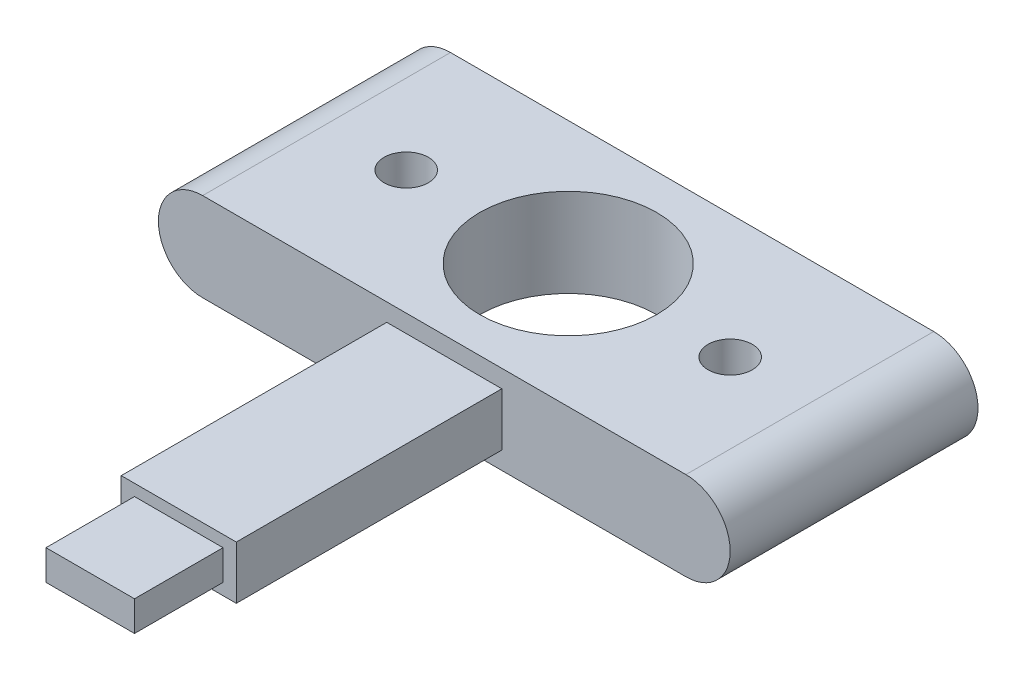
ISO-10303-21;
HEADER;
FILE_DESCRIPTION(('STEP AP214'),'2;1');
FILE_NAME('part.step','',(''),(''),'','','');
FILE_SCHEMA(('AUTOMOTIVE_DESIGN { 1 0 10303 214 1 1 1 1 }'));
ENDSEC;
DATA;
#1=APPLICATION_CONTEXT('core data for automotive mechanical design processes');
#2=APPLICATION_PROTOCOL_DEFINITION('international standard','automotive_design',2000,#1);
#3=PRODUCT_CONTEXT('',#1,'mechanical');
#4=PRODUCT('Part','Part','',(#3));
#5=PRODUCT_RELATED_PRODUCT_CATEGORY('part','',(#4));
#6=PRODUCT_DEFINITION_FORMATION('','',#4);
#7=PRODUCT_DEFINITION_CONTEXT('part definition',#1,'design');
#8=PRODUCT_DEFINITION('design','',#6,#7);
#9=PRODUCT_DEFINITION_SHAPE('','',#8);
#10=(LENGTH_UNIT() NAMED_UNIT(*) SI_UNIT(.MILLI.,.METRE.));
#11=(NAMED_UNIT(*) PLANE_ANGLE_UNIT() SI_UNIT($,.RADIAN.));
#12=(NAMED_UNIT(*) SI_UNIT($,.STERADIAN.) SOLID_ANGLE_UNIT());
#13=UNCERTAINTY_MEASURE_WITH_UNIT(LENGTH_MEASURE(1.E-05),#10,'distance_accuracy_value','');
#14=(GEOMETRIC_REPRESENTATION_CONTEXT(3) GLOBAL_UNCERTAINTY_ASSIGNED_CONTEXT((#13)) GLOBAL_UNIT_ASSIGNED_CONTEXT((#10,
#11,#12)) REPRESENTATION_CONTEXT('',''));
#15=CARTESIAN_POINT('',(0.,0.,0.));
#16=DIRECTION('',(0.,0.,1.));
#17=DIRECTION('',(1.,0.,0.));
#18=AXIS2_PLACEMENT_3D('',#15,#16,#17);
#19=CARTESIAN_POINT('',(32.766,-41.5233681196504,73.66));
#20=DIRECTION('',(0.,0.,1.));
#21=DIRECTION('',(1.,0.,0.));
#22=AXIS2_PLACEMENT_3D('',#19,#20,#21);
#23=PLANE('',#22);
#24=DIRECTION('',(-1.,0.,0.));
#25=VECTOR('',#24,1.);
#26=CARTESIAN_POINT('',(32.766,2.54,73.66));
#27=LINE('',#26,#25);
#28=CARTESIAN_POINT('',(49.276,2.54,73.66));
#29=VERTEX_POINT('',#28);
#30=CARTESIAN_POINT('',(32.766,2.54,73.66));
#31=VERTEX_POINT('',#30);
#32=EDGE_CURVE('E11',#29,#31,#27,.T.);
#33=ORIENTED_EDGE('',*,*,#32,.F.);
#34=DIRECTION('',(0.,1.,0.));
#35=VECTOR('',#34,1.);
#36=CARTESIAN_POINT('',(49.276,-41.5233681196504,73.66));
#37=LINE('',#36,#35);
#38=CARTESIAN_POINT('',(49.276,10.16,73.66));
#39=VERTEX_POINT('',#38);
#40=EDGE_CURVE('E173',#29,#39,#37,.T.);
#41=ORIENTED_EDGE('',*,*,#40,.T.);
#42=DIRECTION('',(1.,0.,0.));
#43=VECTOR('',#42,1.);
#44=CARTESIAN_POINT('',(32.766,10.16,73.66));
#45=LINE('',#44,#43);
#46=CARTESIAN_POINT('',(32.766,10.16,73.66));
#47=VERTEX_POINT('',#46);
#48=EDGE_CURVE('E44',#47,#39,#45,.T.);
#49=ORIENTED_EDGE('',*,*,#48,.F.);
#50=DIRECTION('',(0.,1.,0.));
#51=VECTOR('',#50,1.);
#52=CARTESIAN_POINT('',(32.766,-41.5233681196504,73.66));
#53=LINE('',#52,#51);
#54=EDGE_CURVE('E168',#31,#47,#53,.T.);
#55=ORIENTED_EDGE('',*,*,#54,.F.);
#56=EDGE_LOOP('',(#33,#41,#49,#55));
#57=FACE_BOUND('',#56,.T.);
#58=DIRECTION('',(-1.,0.,0.));
#59=VECTOR('',#58,1.);
#60=CARTESIAN_POINT('',(34.671,8.509,73.66));
#61=LINE('',#60,#59);
#62=CARTESIAN_POINT('',(47.371,8.509,73.66));
#63=VERTEX_POINT('',#62);
#64=CARTESIAN_POINT('',(34.671,8.509,73.66));
#65=VERTEX_POINT('',#64);
#66=EDGE_CURVE('E459',#63,#65,#61,.T.);
#67=ORIENTED_EDGE('',*,*,#66,.F.);
#68=DIRECTION('',(0.,1.,0.));
#69=VECTOR('',#68,1.);
#70=CARTESIAN_POINT('',(47.371,4.191,73.66));
#71=LINE('',#70,#69);
#72=CARTESIAN_POINT('',(47.371,4.191,73.66));
#73=VERTEX_POINT('',#72);
#74=EDGE_CURVE('E148',#73,#63,#71,.T.);
#75=ORIENTED_EDGE('',*,*,#74,.F.);
#76=DIRECTION('',(1.,0.,0.));
#77=VECTOR('',#76,1.);
#78=CARTESIAN_POINT('',(34.671,4.191,73.66));
#79=LINE('',#78,#77);
#80=CARTESIAN_POINT('',(34.671,4.191,73.66));
#81=VERTEX_POINT('',#80);
#82=EDGE_CURVE('E144',#81,#73,#79,.T.);
#83=ORIENTED_EDGE('',*,*,#82,.F.);
#84=DIRECTION('',(0.,-1.,0.));
#85=VECTOR('',#84,1.);
#86=CARTESIAN_POINT('',(34.671,4.191,73.66));
#87=LINE('',#86,#85);
#88=EDGE_CURVE('E461',#65,#81,#87,.T.);
#89=ORIENTED_EDGE('',*,*,#88,.F.);
#90=EDGE_LOOP('',(#67,#75,#83,#89));
#91=FACE_BOUND('',#90,.T.);
#92=ADVANCED_FACE('F34',(#57,#91),#23,.T.);
#93=CARTESIAN_POINT('',(0.,12.7,35.56));
#94=DIRECTION('',(0.,1.,0.));
#95=DIRECTION('',(0.,0.,1.));
#96=AXIS2_PLACEMENT_3D('',#93,#94,#95);
#97=PLANE('',#96);
#98=CARTESIAN_POINT('',(17.78,12.7,17.78));
#99=DIRECTION('',(0.,1.,0.));
#100=DIRECTION('',(0.,0.,-1.));
#101=AXIS2_PLACEMENT_3D('',#98,#99,#100);
#102=CIRCLE('',#101,3.175);
#103=CARTESIAN_POINT('',(17.78,12.7,14.605));
#104=VERTEX_POINT('',#103);
#105=EDGE_CURVE('E440',#104,#104,#102,.T.);
#106=ORIENTED_EDGE('',*,*,#105,.F.);
#107=EDGE_LOOP('',(#106));
#108=FACE_BOUND('',#107,.T.);
#109=CARTESIAN_POINT('',(64.262,12.7,17.78));
#110=DIRECTION('',(0.,1.,0.));
#111=DIRECTION('',(0.,0.,1.));
#112=AXIS2_PLACEMENT_3D('',#109,#110,#111);
#113=CIRCLE('',#112,3.175);
#114=CARTESIAN_POINT('',(64.262,12.7,20.955));
#115=VERTEX_POINT('',#114);
#116=EDGE_CURVE('E439',#115,#115,#113,.T.);
#117=ORIENTED_EDGE('',*,*,#116,.F.);
#118=EDGE_LOOP('',(#117));
#119=FACE_BOUND('',#118,.T.);
#120=CARTESIAN_POINT('',(41.021,12.7,17.78));
#121=DIRECTION('',(0.,1.,0.));
#122=DIRECTION('',(0.,0.,1.));
#123=AXIS2_PLACEMENT_3D('',#120,#121,#122);
#124=CIRCLE('',#123,12.7);
#125=CARTESIAN_POINT('',(41.021,12.7,30.48));
#126=VERTEX_POINT('',#125);
#127=EDGE_CURVE('E449',#126,#126,#124,.T.);
#128=ORIENTED_EDGE('',*,*,#127,.F.);
#129=EDGE_LOOP('',(#128));
#130=FACE_BOUND('',#129,.T.);
#131=DIRECTION('',(1.,0.,0.));
#132=VECTOR('',#131,1.);
#133=CARTESIAN_POINT('',(0.,12.7,35.56));
#134=LINE('',#133,#132);
#135=CARTESIAN_POINT('',(6.34999999999999,12.7,35.56));
#136=VERTEX_POINT('',#135);
#137=CARTESIAN_POINT('',(75.692,12.7,35.56));
#138=VERTEX_POINT('',#137);
#139=EDGE_CURVE('E186',#136,#138,#134,.T.);
#140=ORIENTED_EDGE('',*,*,#139,.T.);
#141=DIRECTION('',(0.,0.,-1.));
#142=VECTOR('',#141,1.);
#143=CARTESIAN_POINT('',(75.692,12.7,35.56));
#144=LINE('',#143,#142);
#145=CARTESIAN_POINT('',(75.692,12.7,0.));
#146=VERTEX_POINT('',#145);
#147=EDGE_CURVE('E193',#138,#146,#144,.T.);
#148=ORIENTED_EDGE('',*,*,#147,.T.);
#149=DIRECTION('',(1.,0.,0.));
#150=VECTOR('',#149,1.);
#151=CARTESIAN_POINT('',(0.,12.7,0.));
#152=LINE('',#151,#150);
#153=CARTESIAN_POINT('',(6.34999999999999,12.7,0.));
#154=VERTEX_POINT('',#153);
#155=EDGE_CURVE('E194',#154,#146,#152,.T.);
#156=ORIENTED_EDGE('',*,*,#155,.F.);
#157=DIRECTION('',(0.,0.,-1.));
#158=VECTOR('',#157,1.);
#159=CARTESIAN_POINT('',(6.34999999999999,12.7,35.56));
#160=LINE('',#159,#158);
#161=EDGE_CURVE('E179',#136,#154,#160,.T.);
#162=ORIENTED_EDGE('',*,*,#161,.F.);
#163=EDGE_LOOP('',(#140,#148,#156,#162));
#164=FACE_BOUND('',#163,.T.);
#165=ADVANCED_FACE('F36',(#108,#119,#130,#164),#97,.T.);
#166=CARTESIAN_POINT('',(6.34999999999999,6.35,35.56));
#167=DIRECTION('',(0.,0.,-1.));
#168=DIRECTION('',(-1.,0.,0.));
#169=AXIS2_PLACEMENT_3D('',#166,#167,#168);
#170=CYLINDRICAL_SURFACE('',#169,6.35);
#171=CARTESIAN_POINT('',(6.34999999999999,6.35,0.));
#172=DIRECTION('',(0.,0.,1.));
#173=DIRECTION('',(1.,0.,0.));
#174=AXIS2_PLACEMENT_3D('',#171,#172,#173);
#175=CIRCLE('',#174,6.35);
#176=CARTESIAN_POINT('',(6.34999999999999,0.,0.));
#177=VERTEX_POINT('',#176);
#178=EDGE_CURVE('E197',#154,#177,#175,.T.);
#179=ORIENTED_EDGE('',*,*,#178,.T.);
#180=DIRECTION('',(0.,0.,-1.));
#181=VECTOR('',#180,1.);
#182=CARTESIAN_POINT('',(6.34999999999999,0.,35.56));
#183=LINE('',#182,#181);
#184=CARTESIAN_POINT('',(6.34999999999999,0.,35.56));
#185=VERTEX_POINT('',#184);
#186=EDGE_CURVE('E208',#185,#177,#183,.T.);
#187=ORIENTED_EDGE('',*,*,#186,.F.);
#188=CARTESIAN_POINT('',(6.34999999999999,6.35,35.56));
#189=DIRECTION('',(0.,0.,1.));
#190=DIRECTION('',(1.,0.,0.));
#191=AXIS2_PLACEMENT_3D('',#188,#189,#190);
#192=CIRCLE('',#191,6.35);
#193=EDGE_CURVE('E185',#136,#185,#192,.T.);
#194=ORIENTED_EDGE('',*,*,#193,.F.);
#195=ORIENTED_EDGE('',*,*,#161,.T.);
#196=EDGE_LOOP('',(#179,#187,#194,#195));
#197=FACE_BOUND('',#196,.T.);
#198=ADVANCED_FACE('F213',(#197),#170,.T.);
#199=CARTESIAN_POINT('',(0.,0.,35.56));
#200=DIRECTION('',(0.,1.,0.));
#201=DIRECTION('',(0.,0.,1.));
#202=AXIS2_PLACEMENT_3D('',#199,#200,#201);
#203=PLANE('',#202);
#204=CARTESIAN_POINT('',(41.021,0.,17.78));
#205=DIRECTION('',(0.,1.,0.));
#206=DIRECTION('',(0.,0.,1.));
#207=AXIS2_PLACEMENT_3D('',#204,#205,#206);
#208=CIRCLE('',#207,12.7);
#209=CARTESIAN_POINT('',(41.021,0.,30.48));
#210=VERTEX_POINT('',#209);
#211=EDGE_CURVE('E451',#210,#210,#208,.T.);
#212=ORIENTED_EDGE('',*,*,#211,.T.);
#213=EDGE_LOOP('',(#212));
#214=FACE_BOUND('',#213,.T.);
#215=DIRECTION('',(0.,0.,-1.));
#216=VECTOR('',#215,1.);
#217=CARTESIAN_POINT('',(75.692,0.,35.56));
#218=LINE('',#217,#216);
#219=CARTESIAN_POINT('',(75.692,0.,35.56));
#220=VERTEX_POINT('',#219);
#221=CARTESIAN_POINT('',(75.692,0.,0.));
#222=VERTEX_POINT('',#221);
#223=EDGE_CURVE('E206',#220,#222,#218,.T.);
#224=ORIENTED_EDGE('',*,*,#223,.F.);
#225=DIRECTION('',(1.,0.,0.));
#226=VECTOR('',#225,1.);
#227=CARTESIAN_POINT('',(0.,0.,35.56));
#228=LINE('',#227,#226);
#229=EDGE_CURVE('E180',#185,#220,#228,.T.);
#230=ORIENTED_EDGE('',*,*,#229,.F.);
#231=ORIENTED_EDGE('',*,*,#186,.T.);
#232=DIRECTION('',(1.,0.,0.));
#233=VECTOR('',#232,1.);
#234=CARTESIAN_POINT('',(0.,0.,0.));
#235=LINE('',#234,#233);
#236=EDGE_CURVE('E199',#177,#222,#235,.T.);
#237=ORIENTED_EDGE('',*,*,#236,.T.);
#238=EDGE_LOOP('',(#224,#230,#231,#237));
#239=FACE_BOUND('',#238,.T.);
#240=ADVANCED_FACE('F231',(#214,#239),#203,.F.);
#241=CARTESIAN_POINT('',(75.692,6.35,35.56));
#242=DIRECTION('',(0.,0.,-1.));
#243=DIRECTION('',(-1.,0.,0.));
#244=AXIS2_PLACEMENT_3D('',#241,#242,#243);
#245=CYLINDRICAL_SURFACE('',#244,6.35);
#246=CARTESIAN_POINT('',(75.692,6.35,0.));
#247=DIRECTION('',(0.,0.,1.));
#248=DIRECTION('',(1.,0.,0.));
#249=AXIS2_PLACEMENT_3D('',#246,#247,#248);
#250=CIRCLE('',#249,6.35);
#251=EDGE_CURVE('E202',#146,#222,#250,.F.);
#252=ORIENTED_EDGE('',*,*,#251,.F.);
#253=ORIENTED_EDGE('',*,*,#147,.F.);
#254=CARTESIAN_POINT('',(75.692,6.35,35.56));
#255=DIRECTION('',(0.,0.,1.));
#256=DIRECTION('',(1.,0.,0.));
#257=AXIS2_PLACEMENT_3D('',#254,#255,#256);
#258=CIRCLE('',#257,6.35);
#259=EDGE_CURVE('E184',#138,#220,#258,.F.);
#260=ORIENTED_EDGE('',*,*,#259,.T.);
#261=ORIENTED_EDGE('',*,*,#223,.T.);
#262=EDGE_LOOP('',(#252,#253,#260,#261));
#263=FACE_BOUND('',#262,.T.);
#264=ADVANCED_FACE('F225',(#263),#245,.T.);
#265=CARTESIAN_POINT('',(0.,0.,35.56));
#266=DIRECTION('',(0.,0.,1.));
#267=DIRECTION('',(1.,0.,0.));
#268=AXIS2_PLACEMENT_3D('',#265,#266,#267);
#269=PLANE('',#268);
#270=DIRECTION('',(0.,1.,0.));
#271=VECTOR('',#270,1.);
#272=CARTESIAN_POINT('',(49.276,-41.5233681196504,35.56));
#273=LINE('',#272,#271);
#274=CARTESIAN_POINT('',(49.276,2.54,35.56));
#275=VERTEX_POINT('',#274);
#276=CARTESIAN_POINT('',(49.276,10.16,35.56));
#277=VERTEX_POINT('',#276);
#278=EDGE_CURVE('E175',#275,#277,#273,.T.);
#279=ORIENTED_EDGE('',*,*,#278,.F.);
#280=DIRECTION('',(-1.,0.,0.));
#281=VECTOR('',#280,1.);
#282=CARTESIAN_POINT('',(82.042,2.54,35.56));
#283=LINE('',#282,#281);
#284=CARTESIAN_POINT('',(32.766,2.54,35.56));
#285=VERTEX_POINT('',#284);
#286=EDGE_CURVE('E153',#275,#285,#283,.T.);
#287=ORIENTED_EDGE('',*,*,#286,.T.);
#288=DIRECTION('',(0.,1.,0.));
#289=VECTOR('',#288,1.);
#290=CARTESIAN_POINT('',(32.766,-41.5233681196504,35.56));
#291=LINE('',#290,#289);
#292=CARTESIAN_POINT('',(32.766,10.16,35.56));
#293=VERTEX_POINT('',#292);
#294=EDGE_CURVE('E38',#285,#293,#291,.T.);
#295=ORIENTED_EDGE('',*,*,#294,.T.);
#296=DIRECTION('',(-1.,0.,0.));
#297=VECTOR('',#296,1.);
#298=CARTESIAN_POINT('',(82.042,10.16,35.56));
#299=LINE('',#298,#297);
#300=EDGE_CURVE('E163',#277,#293,#299,.T.);
#301=ORIENTED_EDGE('',*,*,#300,.F.);
#302=EDGE_LOOP('',(#279,#287,#295,#301));
#303=FACE_BOUND('',#302,.T.);
#304=ORIENTED_EDGE('',*,*,#229,.T.);
#305=ORIENTED_EDGE('',*,*,#259,.F.);
#306=ORIENTED_EDGE('',*,*,#139,.F.);
#307=ORIENTED_EDGE('',*,*,#193,.T.);
#308=EDGE_LOOP('',(#304,#305,#306,#307));
#309=FACE_BOUND('',#308,.T.);
#310=ADVANCED_FACE('F227',(#303,#309),#269,.T.);
#311=CARTESIAN_POINT('',(0.,0.,0.));
#312=DIRECTION('',(0.,0.,1.));
#313=DIRECTION('',(1.,0.,0.));
#314=AXIS2_PLACEMENT_3D('',#311,#312,#313);
#315=PLANE('',#314);
#316=ORIENTED_EDGE('',*,*,#155,.T.);
#317=ORIENTED_EDGE('',*,*,#251,.T.);
#318=ORIENTED_EDGE('',*,*,#236,.F.);
#319=ORIENTED_EDGE('',*,*,#178,.F.);
#320=EDGE_LOOP('',(#316,#317,#318,#319));
#321=FACE_BOUND('',#320,.T.);
#322=ADVANCED_FACE('F220',(#321),#315,.F.);
#323=CARTESIAN_POINT('',(32.766,-41.5233681196504,35.56));
#324=DIRECTION('',(-1.,0.,0.));
#325=DIRECTION('',(0.,0.,1.));
#326=AXIS2_PLACEMENT_3D('',#323,#324,#325);
#327=PLANE('',#326);
#328=DIRECTION('',(0.,0.,-1.));
#329=VECTOR('',#328,1.);
#330=CARTESIAN_POINT('',(32.766,2.54,35.56));
#331=LINE('',#330,#329);
#332=EDGE_CURVE('E150',#31,#285,#331,.T.);
#333=ORIENTED_EDGE('',*,*,#332,.F.);
#334=ORIENTED_EDGE('',*,*,#54,.T.);
#335=DIRECTION('',(0.,0.,1.));
#336=VECTOR('',#335,1.);
#337=CARTESIAN_POINT('',(32.766,10.16,35.56));
#338=LINE('',#337,#336);
#339=EDGE_CURVE('E160',#293,#47,#338,.T.);
#340=ORIENTED_EDGE('',*,*,#339,.F.);
#341=ORIENTED_EDGE('',*,*,#294,.F.);
#342=EDGE_LOOP('',(#333,#334,#340,#341));
#343=FACE_BOUND('',#342,.T.);
#344=ADVANCED_FACE('F253',(#343),#327,.T.);
#345=CARTESIAN_POINT('',(49.276,-41.5233681196504,35.56));
#346=DIRECTION('',(1.,0.,0.));
#347=DIRECTION('',(0.,0.,-1.));
#348=AXIS2_PLACEMENT_3D('',#345,#346,#347);
#349=PLANE('',#348);
#350=DIRECTION('',(0.,0.,1.));
#351=VECTOR('',#350,1.);
#352=CARTESIAN_POINT('',(49.276,2.54,35.56));
#353=LINE('',#352,#351);
#354=EDGE_CURVE('E59',#275,#29,#353,.T.);
#355=ORIENTED_EDGE('',*,*,#354,.F.);
#356=ORIENTED_EDGE('',*,*,#278,.T.);
#357=DIRECTION('',(0.,0.,-1.));
#358=VECTOR('',#357,1.);
#359=CARTESIAN_POINT('',(49.276,10.16,35.56));
#360=LINE('',#359,#358);
#361=EDGE_CURVE('E166',#39,#277,#360,.T.);
#362=ORIENTED_EDGE('',*,*,#361,.F.);
#363=ORIENTED_EDGE('',*,*,#40,.F.);
#364=EDGE_LOOP('',(#355,#356,#362,#363));
#365=FACE_BOUND('',#364,.T.);
#366=ADVANCED_FACE('F251',(#365),#349,.T.);
#367=CARTESIAN_POINT('',(82.042,10.16,35.56));
#368=DIRECTION('',(0.,-1.,0.));
#369=DIRECTION('',(0.,0.,-1.));
#370=AXIS2_PLACEMENT_3D('',#367,#368,#369);
#371=PLANE('',#370);
#372=ORIENTED_EDGE('',*,*,#361,.T.);
#373=ORIENTED_EDGE('',*,*,#300,.T.);
#374=ORIENTED_EDGE('',*,*,#339,.T.);
#375=ORIENTED_EDGE('',*,*,#48,.T.);
#376=EDGE_LOOP('',(#372,#373,#374,#375));
#377=FACE_BOUND('',#376,.T.);
#378=ADVANCED_FACE('F277',(#377),#371,.F.);
#379=CARTESIAN_POINT('',(82.042,2.54,35.56));
#380=DIRECTION('',(0.,1.,0.));
#381=DIRECTION('',(0.,0.,1.));
#382=AXIS2_PLACEMENT_3D('',#379,#380,#381);
#383=PLANE('',#382);
#384=ORIENTED_EDGE('',*,*,#354,.T.);
#385=ORIENTED_EDGE('',*,*,#32,.T.);
#386=ORIENTED_EDGE('',*,*,#332,.T.);
#387=ORIENTED_EDGE('',*,*,#286,.F.);
#388=EDGE_LOOP('',(#384,#385,#386,#387));
#389=FACE_BOUND('',#388,.T.);
#390=ADVANCED_FACE('F284',(#389),#383,.F.);
#391=CARTESIAN_POINT('',(47.371,4.191,86.36));
#392=DIRECTION('',(-1.,0.,0.));
#393=DIRECTION('',(0.,0.,1.));
#394=AXIS2_PLACEMENT_3D('',#391,#392,#393);
#395=PLANE('',#394);
#396=ORIENTED_EDGE('',*,*,#74,.T.);
#397=DIRECTION('',(0.,0.,-1.));
#398=VECTOR('',#397,1.);
#399=CARTESIAN_POINT('',(47.371,8.509,86.36));
#400=LINE('',#399,#398);
#401=CARTESIAN_POINT('',(47.371,8.509,86.36));
#402=VERTEX_POINT('',#401);
#403=EDGE_CURVE('E129',#402,#63,#400,.T.);
#404=ORIENTED_EDGE('',*,*,#403,.F.);
#405=DIRECTION('',(0.,1.,0.));
#406=VECTOR('',#405,1.);
#407=CARTESIAN_POINT('',(47.371,4.191,86.36));
#408=LINE('',#407,#406);
#409=CARTESIAN_POINT('',(47.371,4.191,86.36));
#410=VERTEX_POINT('',#409);
#411=EDGE_CURVE('E136',#410,#402,#408,.T.);
#412=ORIENTED_EDGE('',*,*,#411,.F.);
#413=DIRECTION('',(0.,0.,-1.));
#414=VECTOR('',#413,1.);
#415=CARTESIAN_POINT('',(47.371,4.191,86.36));
#416=LINE('',#415,#414);
#417=EDGE_CURVE('E457',#410,#73,#416,.T.);
#418=ORIENTED_EDGE('',*,*,#417,.T.);
#419=EDGE_LOOP('',(#396,#404,#412,#418));
#420=FACE_BOUND('',#419,.T.);
#421=ADVANCED_FACE('F146',(#420),#395,.F.);
#422=CARTESIAN_POINT('',(34.671,8.509,86.36));
#423=DIRECTION('',(0.,-1.,0.));
#424=DIRECTION('',(0.,0.,-1.));
#425=AXIS2_PLACEMENT_3D('',#422,#423,#424);
#426=PLANE('',#425);
#427=ORIENTED_EDGE('',*,*,#66,.T.);
#428=DIRECTION('',(0.,0.,-1.));
#429=VECTOR('',#428,1.);
#430=CARTESIAN_POINT('',(34.671,8.509,86.36));
#431=LINE('',#430,#429);
#432=CARTESIAN_POINT('',(34.671,8.509,86.36));
#433=VERTEX_POINT('',#432);
#434=EDGE_CURVE('E132',#433,#65,#431,.T.);
#435=ORIENTED_EDGE('',*,*,#434,.F.);
#436=DIRECTION('',(-1.,0.,0.));
#437=VECTOR('',#436,1.);
#438=CARTESIAN_POINT('',(34.671,8.509,86.36));
#439=LINE('',#438,#437);
#440=EDGE_CURVE('E125',#402,#433,#439,.T.);
#441=ORIENTED_EDGE('',*,*,#440,.F.);
#442=ORIENTED_EDGE('',*,*,#403,.T.);
#443=EDGE_LOOP('',(#427,#435,#441,#442));
#444=FACE_BOUND('',#443,.T.);
#445=ADVANCED_FACE('F127',(#444),#426,.F.);
#446=CARTESIAN_POINT('',(34.671,4.191,86.36));
#447=DIRECTION('',(1.,0.,0.));
#448=DIRECTION('',(0.,0.,-1.));
#449=AXIS2_PLACEMENT_3D('',#446,#447,#448);
#450=PLANE('',#449);
#451=ORIENTED_EDGE('',*,*,#88,.T.);
#452=DIRECTION('',(0.,0.,-1.));
#453=VECTOR('',#452,1.);
#454=CARTESIAN_POINT('',(34.671,4.191,86.36));
#455=LINE('',#454,#453);
#456=CARTESIAN_POINT('',(34.671,4.191,86.36));
#457=VERTEX_POINT('',#456);
#458=EDGE_CURVE('E52',#457,#81,#455,.T.);
#459=ORIENTED_EDGE('',*,*,#458,.F.);
#460=DIRECTION('',(0.,-1.,0.));
#461=VECTOR('',#460,1.);
#462=CARTESIAN_POINT('',(34.671,4.191,86.36));
#463=LINE('',#462,#461);
#464=EDGE_CURVE('E135',#433,#457,#463,.T.);
#465=ORIENTED_EDGE('',*,*,#464,.F.);
#466=ORIENTED_EDGE('',*,*,#434,.T.);
#467=EDGE_LOOP('',(#451,#459,#465,#466));
#468=FACE_BOUND('',#467,.T.);
#469=ADVANCED_FACE('F303',(#468),#450,.F.);
#470=CARTESIAN_POINT('',(34.671,4.191,86.36));
#471=DIRECTION('',(0.,1.,0.));
#472=DIRECTION('',(0.,0.,1.));
#473=AXIS2_PLACEMENT_3D('',#470,#471,#472);
#474=PLANE('',#473);
#475=ORIENTED_EDGE('',*,*,#82,.T.);
#476=ORIENTED_EDGE('',*,*,#417,.F.);
#477=DIRECTION('',(1.,0.,0.));
#478=VECTOR('',#477,1.);
#479=CARTESIAN_POINT('',(34.671,4.191,86.36));
#480=LINE('',#479,#478);
#481=EDGE_CURVE('E140',#457,#410,#480,.T.);
#482=ORIENTED_EDGE('',*,*,#481,.F.);
#483=ORIENTED_EDGE('',*,*,#458,.T.);
#484=EDGE_LOOP('',(#475,#476,#482,#483));
#485=FACE_BOUND('',#484,.T.);
#486=ADVANCED_FACE('F310',(#485),#474,.F.);
#487=CARTESIAN_POINT('',(0.,0.,86.36));
#488=DIRECTION('',(0.,0.,-1.));
#489=DIRECTION('',(-1.,0.,0.));
#490=AXIS2_PLACEMENT_3D('',#487,#488,#489);
#491=PLANE('',#490);
#492=ORIENTED_EDGE('',*,*,#411,.T.);
#493=ORIENTED_EDGE('',*,*,#440,.T.);
#494=ORIENTED_EDGE('',*,*,#464,.T.);
#495=ORIENTED_EDGE('',*,*,#481,.T.);
#496=EDGE_LOOP('',(#492,#493,#494,#495));
#497=FACE_BOUND('',#496,.T.);
#498=ADVANCED_FACE('F139',(#497),#491,.F.);
#499=CARTESIAN_POINT('',(41.021,0.,17.78));
#500=DIRECTION('',(0.,1.,0.));
#501=DIRECTION('',(0.,0.,1.));
#502=AXIS2_PLACEMENT_3D('',#499,#500,#501);
#503=CYLINDRICAL_SURFACE('',#502,12.7);
#504=ORIENTED_EDGE('',*,*,#211,.F.);
#505=EDGE_LOOP('',(#504));
#506=FACE_BOUND('',#505,.T.);
#507=ORIENTED_EDGE('',*,*,#127,.T.);
#508=EDGE_LOOP('',(#507));
#509=FACE_BOUND('',#508,.T.);
#510=ADVANCED_FACE('F324',(#506,#509),#503,.F.);
#511=CARTESIAN_POINT('',(64.262,7.62000000000001,17.78));
#512=DIRECTION('',(0.,1.,0.));
#513=DIRECTION('',(0.,0.,1.));
#514=AXIS2_PLACEMENT_3D('',#511,#512,#513);
#515=CYLINDRICAL_SURFACE('',#514,3.175);
#516=CARTESIAN_POINT('',(64.262,7.62000000000001,17.78));
#517=DIRECTION('',(0.,1.,0.));
#518=DIRECTION('',(0.,0.,1.));
#519=AXIS2_PLACEMENT_3D('',#516,#517,#518);
#520=CIRCLE('',#519,3.175);
#521=CARTESIAN_POINT('',(64.262,7.62000000000001,20.955));
#522=VERTEX_POINT('',#521);
#523=EDGE_CURVE('E443',#522,#522,#520,.T.);
#524=ORIENTED_EDGE('',*,*,#523,.F.);
#525=EDGE_LOOP('',(#524));
#526=FACE_BOUND('',#525,.T.);
#527=ORIENTED_EDGE('',*,*,#116,.T.);
#528=EDGE_LOOP('',(#527));
#529=FACE_BOUND('',#528,.T.);
#530=ADVANCED_FACE('F331',(#526,#529),#515,.F.);
#531=CARTESIAN_POINT('',(64.262,7.62000000000001,17.78));
#532=DIRECTION('',(0.,1.,0.));
#533=DIRECTION('',(0.,0.,1.));
#534=AXIS2_PLACEMENT_3D('',#531,#532,#533);
#535=PLANE('',#534);
#536=ORIENTED_EDGE('',*,*,#523,.T.);
#537=EDGE_LOOP('',(#536));
#538=FACE_BOUND('',#537,.T.);
#539=ADVANCED_FACE('F340',(#538),#535,.T.);
#540=CARTESIAN_POINT('',(17.78,7.62000000000001,17.78));
#541=DIRECTION('',(0.,1.,0.));
#542=DIRECTION('',(0.,0.,1.));
#543=AXIS2_PLACEMENT_3D('',#540,#541,#542);
#544=CYLINDRICAL_SURFACE('',#543,3.175);
#545=CARTESIAN_POINT('',(17.78,7.62000000000001,17.78));
#546=DIRECTION('',(0.,1.,0.));
#547=DIRECTION('',(0.,0.,-1.));
#548=AXIS2_PLACEMENT_3D('',#545,#546,#547);
#549=CIRCLE('',#548,3.175);
#550=CARTESIAN_POINT('',(17.78,7.62000000000001,14.605));
#551=VERTEX_POINT('',#550);
#552=EDGE_CURVE('E438',#551,#551,#549,.T.);
#553=ORIENTED_EDGE('',*,*,#552,.F.);
#554=EDGE_LOOP('',(#553));
#555=FACE_BOUND('',#554,.T.);
#556=ORIENTED_EDGE('',*,*,#105,.T.);
#557=EDGE_LOOP('',(#556));
#558=FACE_BOUND('',#557,.T.);
#559=ADVANCED_FACE('F348',(#555,#558),#544,.F.);
#560=CARTESIAN_POINT('',(17.78,7.62000000000001,17.78));
#561=DIRECTION('',(0.,-1.,0.));
#562=DIRECTION('',(0.,0.,-1.));
#563=AXIS2_PLACEMENT_3D('',#560,#561,#562);
#564=PLANE('',#563);
#565=ORIENTED_EDGE('',*,*,#552,.T.);
#566=EDGE_LOOP('',(#565));
#567=FACE_BOUND('',#566,.T.);
#568=ADVANCED_FACE('F356',(#567),#564,.F.);
#569=CLOSED_SHELL('',(#92,#165,#198,#240,#264,#310,#322,#344,#366,#378,#390,#421,#445,#469,#486,
#498,#510,#530,#539,#559,#568));
#570=MANIFOLD_SOLID_BREP('B2',#569);
#571=ADVANCED_BREP_SHAPE_REPRESENTATION('',(#18,#570),#14);
#572=SHAPE_DEFINITION_REPRESENTATION(#9,#571);
ENDSEC;
END-ISO-10303-21;
